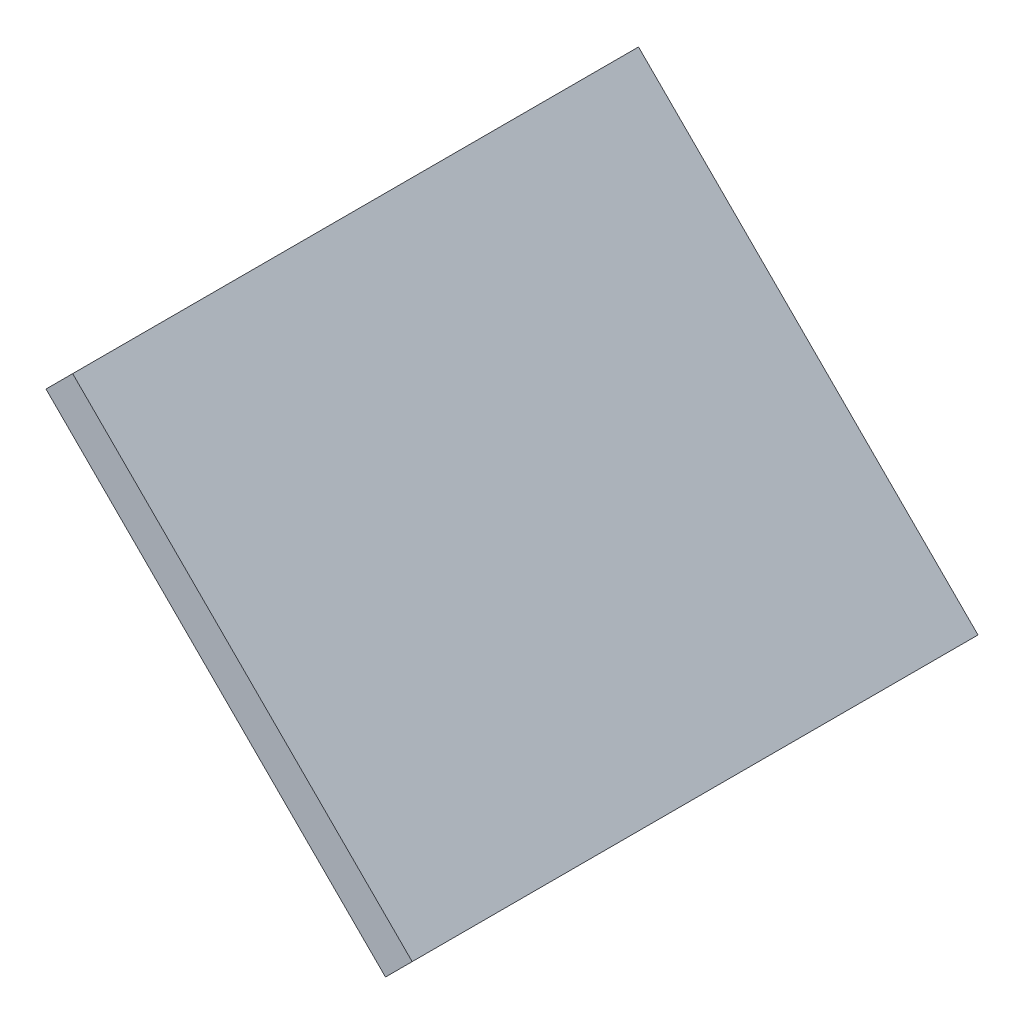
ISO-10303-21;
HEADER;
FILE_DESCRIPTION(('STEP AP214'),'2;1');
FILE_NAME('part.step','',(''),(''),'','','');
FILE_SCHEMA(('AUTOMOTIVE_DESIGN { 1 0 10303 214 1 1 1 1 }'));
ENDSEC;
DATA;
#1=APPLICATION_CONTEXT('core data for automotive mechanical design processes');
#2=APPLICATION_PROTOCOL_DEFINITION('international standard','automotive_design',2000,#1);
#3=PRODUCT_CONTEXT('',#1,'mechanical');
#4=PRODUCT('Part','Part','',(#3));
#5=PRODUCT_RELATED_PRODUCT_CATEGORY('part','',(#4));
#6=PRODUCT_DEFINITION_FORMATION('','',#4);
#7=PRODUCT_DEFINITION_CONTEXT('part definition',#1,'design');
#8=PRODUCT_DEFINITION('design','',#6,#7);
#9=PRODUCT_DEFINITION_SHAPE('','',#8);
#10=(LENGTH_UNIT() NAMED_UNIT(*) SI_UNIT(.MILLI.,.METRE.));
#11=(NAMED_UNIT(*) PLANE_ANGLE_UNIT() SI_UNIT($,.RADIAN.));
#12=(NAMED_UNIT(*) SI_UNIT($,.STERADIAN.) SOLID_ANGLE_UNIT());
#13=UNCERTAINTY_MEASURE_WITH_UNIT(LENGTH_MEASURE(1.E-05),#10,'distance_accuracy_value','');
#14=(GEOMETRIC_REPRESENTATION_CONTEXT(3) GLOBAL_UNCERTAINTY_ASSIGNED_CONTEXT((#13)) GLOBAL_UNIT_ASSIGNED_CONTEXT((#10,
#11,#12)) REPRESENTATION_CONTEXT('',''));
#15=CARTESIAN_POINT('',(0.,0.,0.));
#16=DIRECTION('',(0.,0.,1.));
#17=DIRECTION('',(1.,0.,0.));
#18=AXIS2_PLACEMENT_3D('',#15,#16,#17);
#19=CARTESIAN_POINT('',(48.5355339059326,-41.4644660940673,75.));
#20=DIRECTION('',(-0.707106781186548,-0.707106781186547,0.));
#21=DIRECTION('',(0.707106781186547,-0.707106781186548,0.));
#22=AXIS2_PLACEMENT_3D('',#19,#20,#21);
#23=PLANE('',#22);
#24=DIRECTION('',(-0.707106781186547,0.707106781186548,0.));
#25=VECTOR('',#24,1.);
#26=CARTESIAN_POINT('',(48.5355339059326,-41.4644660940673,-75.));
#27=LINE('',#26,#25);
#28=CARTESIAN_POINT('',(48.5355339059326,-41.4644660940673,-75.));
#29=VERTEX_POINT('',#28);
#30=CARTESIAN_POINT('',(-41.4644660940671,48.5355339059327,-75.));
#31=VERTEX_POINT('',#30);
#32=EDGE_CURVE('E102',#29,#31,#27,.T.);
#33=ORIENTED_EDGE('',*,*,#32,.T.);
#34=DIRECTION('',(0.,0.,-1.));
#35=VECTOR('',#34,1.);
#36=CARTESIAN_POINT('',(-41.4644660940671,48.5355339059327,75.));
#37=LINE('',#36,#35);
#38=CARTESIAN_POINT('',(-41.4644660940671,48.5355339059327,75.));
#39=VERTEX_POINT('',#38);
#40=EDGE_CURVE('E11',#39,#31,#37,.T.);
#41=ORIENTED_EDGE('',*,*,#40,.F.);
#42=DIRECTION('',(-0.707106781186547,0.707106781186548,0.));
#43=VECTOR('',#42,1.);
#44=CARTESIAN_POINT('',(48.5355339059326,-41.4644660940673,75.));
#45=LINE('',#44,#43);
#46=CARTESIAN_POINT('',(48.5355339059326,-41.4644660940673,75.));
#47=VERTEX_POINT('',#46);
#48=EDGE_CURVE('E79',#47,#39,#45,.T.);
#49=ORIENTED_EDGE('',*,*,#48,.F.);
#50=DIRECTION('',(0.,0.,-1.));
#51=VECTOR('',#50,1.);
#52=CARTESIAN_POINT('',(48.5355339059326,-41.4644660940673,75.));
#53=LINE('',#52,#51);
#54=EDGE_CURVE('E55',#47,#29,#53,.T.);
#55=ORIENTED_EDGE('',*,*,#54,.T.);
#56=EDGE_LOOP('',(#33,#41,#49,#55));
#57=FACE_BOUND('',#56,.T.);
#58=ADVANCED_FACE('F39',(#57),#23,.F.);
#59=CARTESIAN_POINT('',(-48.5355339059326,41.4644660940673,75.));
#60=DIRECTION('',(-0.707106781186546,0.707106781186549,0.));
#61=DIRECTION('',(-0.707106781186549,-0.707106781186546,0.));
#62=AXIS2_PLACEMENT_3D('',#59,#60,#61);
#63=PLANE('',#62);
#64=DIRECTION('',(0.707106781186549,0.707106781186546,0.));
#65=VECTOR('',#64,1.);
#66=CARTESIAN_POINT('',(-48.5355339059326,41.4644660940673,-75.));
#67=LINE('',#66,#65);
#68=CARTESIAN_POINT('',(-48.5355339059326,41.4644660940673,-75.));
#69=VERTEX_POINT('',#68);
#70=EDGE_CURVE('E88',#69,#31,#67,.T.);
#71=ORIENTED_EDGE('',*,*,#70,.F.);
#72=DIRECTION('',(0.,0.,-1.));
#73=VECTOR('',#72,1.);
#74=CARTESIAN_POINT('',(-48.5355339059326,41.4644660940673,75.));
#75=LINE('',#74,#73);
#76=CARTESIAN_POINT('',(-48.5355339059326,41.4644660940673,75.));
#77=VERTEX_POINT('',#76);
#78=EDGE_CURVE('E47',#77,#69,#75,.T.);
#79=ORIENTED_EDGE('',*,*,#78,.F.);
#80=DIRECTION('',(0.707106781186549,0.707106781186546,0.));
#81=VECTOR('',#80,1.);
#82=CARTESIAN_POINT('',(-48.5355339059326,41.4644660940673,75.));
#83=LINE('',#82,#81);
#84=EDGE_CURVE('E86',#77,#39,#83,.T.);
#85=ORIENTED_EDGE('',*,*,#84,.T.);
#86=ORIENTED_EDGE('',*,*,#40,.T.);
#87=EDGE_LOOP('',(#71,#79,#85,#86));
#88=FACE_BOUND('',#87,.T.);
#89=ADVANCED_FACE('F85',(#88),#63,.T.);
#90=CARTESIAN_POINT('',(41.4644660940671,-48.5355339059327,75.));
#91=DIRECTION('',(-0.707106781186548,-0.707106781186547,0.));
#92=DIRECTION('',(0.707106781186547,-0.707106781186548,0.));
#93=AXIS2_PLACEMENT_3D('',#90,#91,#92);
#94=PLANE('',#93);
#95=DIRECTION('',(-0.707106781186547,0.707106781186548,0.));
#96=VECTOR('',#95,1.);
#97=CARTESIAN_POINT('',(41.4644660940671,-48.5355339059327,-75.));
#98=LINE('',#97,#96);
#99=CARTESIAN_POINT('',(41.4644660940671,-48.5355339059327,-75.));
#100=VERTEX_POINT('',#99);
#101=EDGE_CURVE('E105',#100,#69,#98,.T.);
#102=ORIENTED_EDGE('',*,*,#101,.F.);
#103=DIRECTION('',(0.,0.,-1.));
#104=VECTOR('',#103,1.);
#105=CARTESIAN_POINT('',(41.4644660940671,-48.5355339059327,75.));
#106=LINE('',#105,#104);
#107=CARTESIAN_POINT('',(41.4644660940671,-48.5355339059327,75.));
#108=VERTEX_POINT('',#107);
#109=EDGE_CURVE('E68',#108,#100,#106,.T.);
#110=ORIENTED_EDGE('',*,*,#109,.F.);
#111=DIRECTION('',(-0.707106781186547,0.707106781186548,0.));
#112=VECTOR('',#111,1.);
#113=CARTESIAN_POINT('',(41.4644660940671,-48.5355339059327,75.));
#114=LINE('',#113,#112);
#115=EDGE_CURVE('E94',#108,#77,#114,.T.);
#116=ORIENTED_EDGE('',*,*,#115,.T.);
#117=ORIENTED_EDGE('',*,*,#78,.T.);
#118=EDGE_LOOP('',(#102,#110,#116,#117));
#119=FACE_BOUND('',#118,.T.);
#120=ADVANCED_FACE('F96',(#119),#94,.T.);
#121=CARTESIAN_POINT('',(48.5355339059326,-41.4644660940673,75.));
#122=DIRECTION('',(0.707106781186546,-0.707106781186549,0.));
#123=DIRECTION('',(0.707106781186549,0.707106781186546,0.));
#124=AXIS2_PLACEMENT_3D('',#121,#122,#123);
#125=PLANE('',#124);
#126=DIRECTION('',(-0.707106781186549,-0.707106781186546,0.));
#127=VECTOR('',#126,1.);
#128=CARTESIAN_POINT('',(48.5355339059326,-41.4644660940673,-75.));
#129=LINE('',#128,#127);
#130=EDGE_CURVE('E107',#29,#100,#129,.T.);
#131=ORIENTED_EDGE('',*,*,#130,.F.);
#132=ORIENTED_EDGE('',*,*,#54,.F.);
#133=DIRECTION('',(-0.707106781186549,-0.707106781186546,0.));
#134=VECTOR('',#133,1.);
#135=CARTESIAN_POINT('',(48.5355339059326,-41.4644660940673,75.));
#136=LINE('',#135,#134);
#137=EDGE_CURVE('E97',#47,#108,#136,.T.);
#138=ORIENTED_EDGE('',*,*,#137,.T.);
#139=ORIENTED_EDGE('',*,*,#109,.T.);
#140=EDGE_LOOP('',(#131,#132,#138,#139));
#141=FACE_BOUND('',#140,.T.);
#142=ADVANCED_FACE('F113',(#141),#125,.T.);
#143=CARTESIAN_POINT('',(0.,0.,75.));
#144=DIRECTION('',(0.,0.,-1.));
#145=DIRECTION('',(-1.,0.,0.));
#146=AXIS2_PLACEMENT_3D('',#143,#144,#145);
#147=PLANE('',#146);
#148=ORIENTED_EDGE('',*,*,#48,.T.);
#149=ORIENTED_EDGE('',*,*,#84,.F.);
#150=ORIENTED_EDGE('',*,*,#115,.F.);
#151=ORIENTED_EDGE('',*,*,#137,.F.);
#152=EDGE_LOOP('',(#148,#149,#150,#151));
#153=FACE_BOUND('',#152,.T.);
#154=ADVANCED_FACE('F93',(#153),#147,.F.);
#155=CARTESIAN_POINT('',(0.,0.,-75.));
#156=DIRECTION('',(0.,0.,-1.));
#157=DIRECTION('',(-1.,0.,0.));
#158=AXIS2_PLACEMENT_3D('',#155,#156,#157);
#159=PLANE('',#158);
#160=ORIENTED_EDGE('',*,*,#32,.F.);
#161=ORIENTED_EDGE('',*,*,#130,.T.);
#162=ORIENTED_EDGE('',*,*,#101,.T.);
#163=ORIENTED_EDGE('',*,*,#70,.T.);
#164=EDGE_LOOP('',(#160,#161,#162,#163));
#165=FACE_BOUND('',#164,.T.);
#166=ADVANCED_FACE('F112',(#165),#159,.T.);
#167=CLOSED_SHELL('',(#58,#89,#120,#142,#154,#166));
#168=MANIFOLD_SOLID_BREP('B2',#167);
#169=ADVANCED_BREP_SHAPE_REPRESENTATION('',(#18,#168),#14);
#170=SHAPE_DEFINITION_REPRESENTATION(#9,#169);
ENDSEC;
END-ISO-10303-21;
